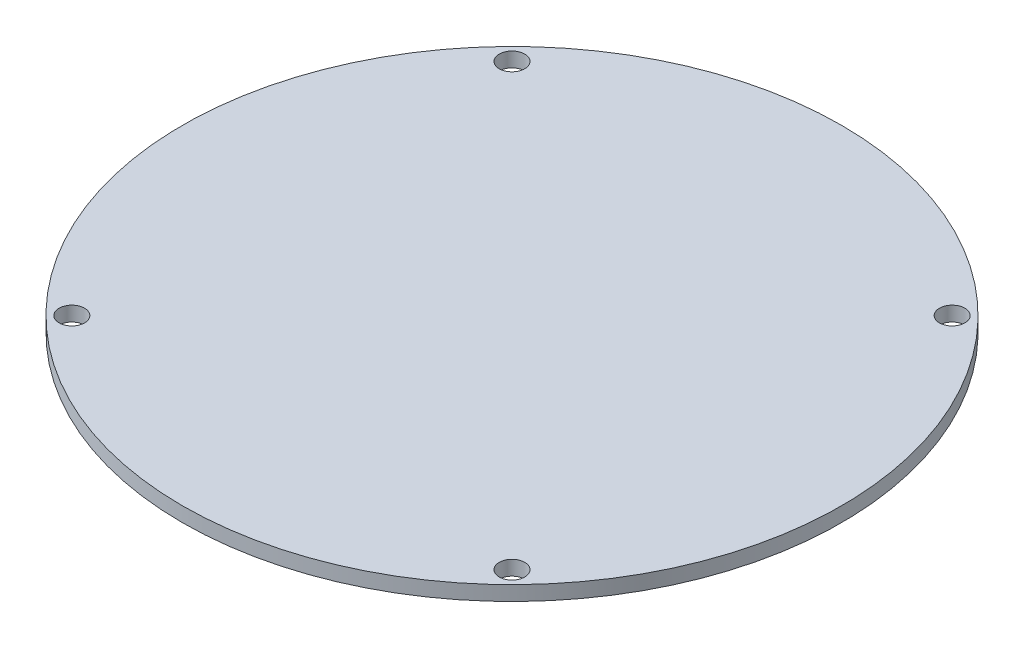
ISO-10303-21;
HEADER;
FILE_DESCRIPTION(('STEP AP214'),'2;1');
FILE_NAME('part.step','',(''),(''),'','','');
FILE_SCHEMA(('AUTOMOTIVE_DESIGN { 1 0 10303 214 1 1 1 1 }'));
ENDSEC;
DATA;
#1=APPLICATION_CONTEXT('core data for automotive mechanical design processes');
#2=APPLICATION_PROTOCOL_DEFINITION('international standard','automotive_design',2000,#1);
#3=PRODUCT_CONTEXT('',#1,'mechanical');
#4=PRODUCT('Part','Part','',(#3));
#5=PRODUCT_RELATED_PRODUCT_CATEGORY('part','',(#4));
#6=PRODUCT_DEFINITION_FORMATION('','',#4);
#7=PRODUCT_DEFINITION_CONTEXT('part definition',#1,'design');
#8=PRODUCT_DEFINITION('design','',#6,#7);
#9=PRODUCT_DEFINITION_SHAPE('','',#8);
#10=(LENGTH_UNIT() NAMED_UNIT(*) SI_UNIT(.MILLI.,.METRE.));
#11=(NAMED_UNIT(*) PLANE_ANGLE_UNIT() SI_UNIT($,.RADIAN.));
#12=(NAMED_UNIT(*) SI_UNIT($,.STERADIAN.) SOLID_ANGLE_UNIT());
#13=UNCERTAINTY_MEASURE_WITH_UNIT(LENGTH_MEASURE(1.E-05),#10,'distance_accuracy_value','');
#14=(GEOMETRIC_REPRESENTATION_CONTEXT(3) GLOBAL_UNCERTAINTY_ASSIGNED_CONTEXT((#13)) GLOBAL_UNIT_ASSIGNED_CONTEXT((#10,
#11,#12)) REPRESENTATION_CONTEXT('',''));
#15=CARTESIAN_POINT('',(0.,0.,0.));
#16=DIRECTION('',(0.,0.,1.));
#17=DIRECTION('',(1.,0.,0.));
#18=AXIS2_PLACEMENT_3D('',#15,#16,#17);
#19=CARTESIAN_POINT('',(0.,2.54,0.));
#20=DIRECTION('',(0.,-1.,0.));
#21=DIRECTION('',(0.,0.,-1.));
#22=AXIS2_PLACEMENT_3D('',#19,#20,#21);
#23=CYLINDRICAL_SURFACE('',#22,57.15);
#24=CARTESIAN_POINT('',(0.,2.54,0.));
#25=DIRECTION('',(0.,1.,0.));
#26=DIRECTION('',(0.,0.,1.));
#27=AXIS2_PLACEMENT_3D('',#24,#25,#26);
#28=CIRCLE('',#27,57.15);
#29=CARTESIAN_POINT('',(0.,2.54,57.15));
#30=VERTEX_POINT('',#29);
#31=EDGE_CURVE('E10',#30,#30,#28,.T.);
#32=ORIENTED_EDGE('',*,*,#31,.F.);
#33=EDGE_LOOP('',(#32));
#34=FACE_BOUND('',#33,.T.);
#35=CARTESIAN_POINT('',(0.,0.,0.));
#36=DIRECTION('',(0.,1.,0.));
#37=DIRECTION('',(0.,0.,1.));
#38=AXIS2_PLACEMENT_3D('',#35,#36,#37);
#39=CIRCLE('',#38,57.15);
#40=CARTESIAN_POINT('',(0.,0.,57.15));
#41=VERTEX_POINT('',#40);
#42=EDGE_CURVE('E36',#41,#41,#39,.T.);
#43=ORIENTED_EDGE('',*,*,#42,.T.);
#44=EDGE_LOOP('',(#43));
#45=FACE_BOUND('',#44,.T.);
#46=ADVANCED_FACE('F33',(#34,#45),#23,.T.);
#47=CARTESIAN_POINT('',(0.,2.54,0.));
#48=DIRECTION('',(0.,1.,0.));
#49=DIRECTION('',(0.,0.,1.));
#50=AXIS2_PLACEMENT_3D('',#47,#48,#49);
#51=PLANE('',#50);
#52=CARTESIAN_POINT('',(-38.1660885145439,2.54,38.1660885145439));
#53=DIRECTION('',(0.,1.,0.));
#54=DIRECTION('',(0.,0.,1.));
#55=AXIS2_PLACEMENT_3D('',#52,#53,#54);
#56=CIRCLE('',#55,2.21082771045228);
#57=CARTESIAN_POINT('',(-38.1660885145439,2.54,40.3769162249962));
#58=VERTEX_POINT('',#57);
#59=EDGE_CURVE('E63',#58,#58,#56,.T.);
#60=ORIENTED_EDGE('',*,*,#59,.F.);
#61=EDGE_LOOP('',(#60));
#62=FACE_BOUND('',#61,.T.);
#63=CARTESIAN_POINT('',(38.1660885145439,2.54,38.1660885145439));
#64=DIRECTION('',(0.,1.,0.));
#65=DIRECTION('',(0.,0.,1.));
#66=AXIS2_PLACEMENT_3D('',#63,#64,#65);
#67=CIRCLE('',#66,2.21082771045228);
#68=CARTESIAN_POINT('',(38.1660885145439,2.54,40.3769162249962));
#69=VERTEX_POINT('',#68);
#70=EDGE_CURVE('E57',#69,#69,#67,.T.);
#71=ORIENTED_EDGE('',*,*,#70,.F.);
#72=EDGE_LOOP('',(#71));
#73=FACE_BOUND('',#72,.T.);
#74=CARTESIAN_POINT('',(38.1660885145439,2.54,-38.1660885145439));
#75=DIRECTION('',(0.,1.,0.));
#76=DIRECTION('',(0.,0.,1.));
#77=AXIS2_PLACEMENT_3D('',#74,#75,#76);
#78=CIRCLE('',#77,2.21082771045228);
#79=CARTESIAN_POINT('',(38.1660885145439,2.54,-35.9552608040916));
#80=VERTEX_POINT('',#79);
#81=EDGE_CURVE('E51',#80,#80,#78,.T.);
#82=ORIENTED_EDGE('',*,*,#81,.F.);
#83=EDGE_LOOP('',(#82));
#84=FACE_BOUND('',#83,.T.);
#85=CARTESIAN_POINT('',(-38.1660885145439,2.54,-38.1660885145439));
#86=DIRECTION('',(0.,1.,0.));
#87=DIRECTION('',(0.,0.,1.));
#88=AXIS2_PLACEMENT_3D('',#85,#86,#87);
#89=CIRCLE('',#88,2.21082771045228);
#90=CARTESIAN_POINT('',(-38.1660885145439,2.54,-35.9552608040916));
#91=VERTEX_POINT('',#90);
#92=EDGE_CURVE('E45',#91,#91,#89,.T.);
#93=ORIENTED_EDGE('',*,*,#92,.F.);
#94=EDGE_LOOP('',(#93));
#95=FACE_BOUND('',#94,.T.);
#96=ORIENTED_EDGE('',*,*,#31,.T.);
#97=EDGE_LOOP('',(#96));
#98=FACE_BOUND('',#97,.T.);
#99=ADVANCED_FACE('F79',(#62,#73,#84,#95,#98),#51,.T.);
#100=CARTESIAN_POINT('',(0.,0.,0.));
#101=DIRECTION('',(0.,1.,0.));
#102=DIRECTION('',(0.,0.,1.));
#103=AXIS2_PLACEMENT_3D('',#100,#101,#102);
#104=PLANE('',#103);
#105=CARTESIAN_POINT('',(-38.1660885145439,0.,38.1660885145439));
#106=DIRECTION('',(0.,1.,0.));
#107=DIRECTION('',(0.,0.,1.));
#108=AXIS2_PLACEMENT_3D('',#105,#106,#107);
#109=CIRCLE('',#108,2.21082771045228);
#110=CARTESIAN_POINT('',(-38.1660885145439,0.,40.3769162249962));
#111=VERTEX_POINT('',#110);
#112=EDGE_CURVE('E60',#111,#111,#109,.T.);
#113=ORIENTED_EDGE('',*,*,#112,.T.);
#114=EDGE_LOOP('',(#113));
#115=FACE_BOUND('',#114,.T.);
#116=CARTESIAN_POINT('',(38.1660885145439,0.,38.1660885145439));
#117=DIRECTION('',(0.,1.,0.));
#118=DIRECTION('',(0.,0.,1.));
#119=AXIS2_PLACEMENT_3D('',#116,#117,#118);
#120=CIRCLE('',#119,2.21082771045228);
#121=CARTESIAN_POINT('',(38.1660885145439,0.,40.3769162249962));
#122=VERTEX_POINT('',#121);
#123=EDGE_CURVE('E54',#122,#122,#120,.T.);
#124=ORIENTED_EDGE('',*,*,#123,.T.);
#125=EDGE_LOOP('',(#124));
#126=FACE_BOUND('',#125,.T.);
#127=CARTESIAN_POINT('',(38.1660885145439,0.,-38.1660885145439));
#128=DIRECTION('',(0.,1.,0.));
#129=DIRECTION('',(0.,0.,1.));
#130=AXIS2_PLACEMENT_3D('',#127,#128,#129);
#131=CIRCLE('',#130,2.21082771045228);
#132=CARTESIAN_POINT('',(38.1660885145439,0.,-35.9552608040916));
#133=VERTEX_POINT('',#132);
#134=EDGE_CURVE('E48',#133,#133,#131,.T.);
#135=ORIENTED_EDGE('',*,*,#134,.T.);
#136=EDGE_LOOP('',(#135));
#137=FACE_BOUND('',#136,.T.);
#138=CARTESIAN_POINT('',(-38.1660885145439,0.,-38.1660885145439));
#139=DIRECTION('',(0.,1.,0.));
#140=DIRECTION('',(0.,0.,1.));
#141=AXIS2_PLACEMENT_3D('',#138,#139,#140);
#142=CIRCLE('',#141,2.21082771045228);
#143=CARTESIAN_POINT('',(-38.1660885145439,0.,-35.9552608040916));
#144=VERTEX_POINT('',#143);
#145=EDGE_CURVE('E43',#144,#144,#142,.T.);
#146=ORIENTED_EDGE('',*,*,#145,.T.);
#147=EDGE_LOOP('',(#146));
#148=FACE_BOUND('',#147,.T.);
#149=ORIENTED_EDGE('',*,*,#42,.F.);
#150=EDGE_LOOP('',(#149));
#151=FACE_BOUND('',#150,.T.);
#152=ADVANCED_FACE('F69',(#115,#126,#137,#148,#151),#104,.F.);
#153=CARTESIAN_POINT('',(-38.1660885145439,0.,-38.1660885145439));
#154=DIRECTION('',(0.,1.,0.));
#155=DIRECTION('',(0.,0.,1.));
#156=AXIS2_PLACEMENT_3D('',#153,#154,#155);
#157=CYLINDRICAL_SURFACE('',#156,2.21082771045228);
#158=ORIENTED_EDGE('',*,*,#145,.F.);
#159=EDGE_LOOP('',(#158));
#160=FACE_BOUND('',#159,.T.);
#161=ORIENTED_EDGE('',*,*,#92,.T.);
#162=EDGE_LOOP('',(#161));
#163=FACE_BOUND('',#162,.T.);
#164=ADVANCED_FACE('F89',(#160,#163),#157,.F.);
#165=CARTESIAN_POINT('',(38.1660885145439,0.,-38.1660885145439));
#166=DIRECTION('',(0.,1.,0.));
#167=DIRECTION('',(0.,0.,1.));
#168=AXIS2_PLACEMENT_3D('',#165,#166,#167);
#169=CYLINDRICAL_SURFACE('',#168,2.21082771045228);
#170=ORIENTED_EDGE('',*,*,#134,.F.);
#171=EDGE_LOOP('',(#170));
#172=FACE_BOUND('',#171,.T.);
#173=ORIENTED_EDGE('',*,*,#81,.T.);
#174=EDGE_LOOP('',(#173));
#175=FACE_BOUND('',#174,.T.);
#176=ADVANCED_FACE('F91',(#172,#175),#169,.F.);
#177=CARTESIAN_POINT('',(38.1660885145439,0.,38.1660885145439));
#178=DIRECTION('',(0.,1.,0.));
#179=DIRECTION('',(0.,0.,1.));
#180=AXIS2_PLACEMENT_3D('',#177,#178,#179);
#181=CYLINDRICAL_SURFACE('',#180,2.21082771045228);
#182=ORIENTED_EDGE('',*,*,#123,.F.);
#183=EDGE_LOOP('',(#182));
#184=FACE_BOUND('',#183,.T.);
#185=ORIENTED_EDGE('',*,*,#70,.T.);
#186=EDGE_LOOP('',(#185));
#187=FACE_BOUND('',#186,.T.);
#188=ADVANCED_FACE('F75',(#184,#187),#181,.F.);
#189=CARTESIAN_POINT('',(-38.1660885145439,0.,38.1660885145439));
#190=DIRECTION('',(0.,1.,0.));
#191=DIRECTION('',(0.,0.,1.));
#192=AXIS2_PLACEMENT_3D('',#189,#190,#191);
#193=CYLINDRICAL_SURFACE('',#192,2.21082771045228);
#194=ORIENTED_EDGE('',*,*,#112,.F.);
#195=EDGE_LOOP('',(#194));
#196=FACE_BOUND('',#195,.T.);
#197=ORIENTED_EDGE('',*,*,#59,.T.);
#198=EDGE_LOOP('',(#197));
#199=FACE_BOUND('',#198,.T.);
#200=ADVANCED_FACE('F72',(#196,#199),#193,.F.);
#201=CLOSED_SHELL('',(#46,#99,#152,#164,#176,#188,#200));
#202=MANIFOLD_SOLID_BREP('B2',#201);
#203=ADVANCED_BREP_SHAPE_REPRESENTATION('',(#18,#202),#14);
#204=SHAPE_DEFINITION_REPRESENTATION(#9,#203);
ENDSEC;
END-ISO-10303-21;
